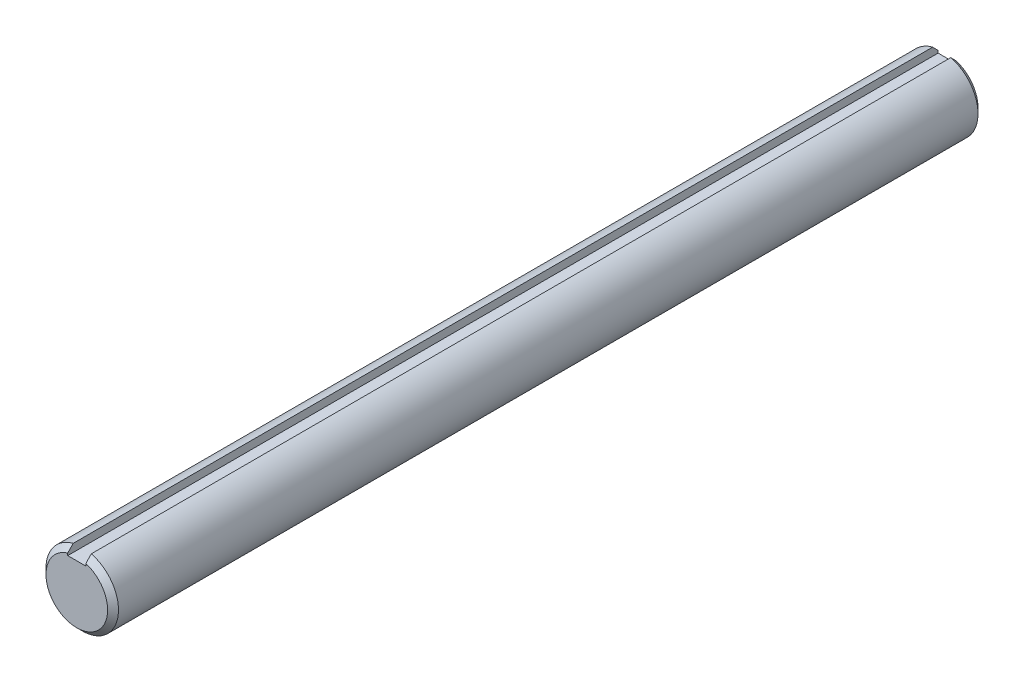
ISO-10303-21;
HEADER;
FILE_DESCRIPTION(('STEP AP214'),'2;1');
FILE_NAME('part.step','',(''),(''),'','','');
FILE_SCHEMA(('AUTOMOTIVE_DESIGN { 1 0 10303 214 1 1 1 1 }'));
ENDSEC;
DATA;
#1=APPLICATION_CONTEXT('core data for automotive mechanical design processes');
#2=APPLICATION_PROTOCOL_DEFINITION('international standard','automotive_design',2000,#1);
#3=PRODUCT_CONTEXT('',#1,'mechanical');
#4=PRODUCT('Part','Part','',(#3));
#5=PRODUCT_RELATED_PRODUCT_CATEGORY('part','',(#4));
#6=PRODUCT_DEFINITION_FORMATION('','',#4);
#7=PRODUCT_DEFINITION_CONTEXT('part definition',#1,'design');
#8=PRODUCT_DEFINITION('design','',#6,#7);
#9=PRODUCT_DEFINITION_SHAPE('','',#8);
#10=(LENGTH_UNIT() NAMED_UNIT(*) SI_UNIT(.MILLI.,.METRE.));
#11=(NAMED_UNIT(*) PLANE_ANGLE_UNIT() SI_UNIT($,.RADIAN.));
#12=(NAMED_UNIT(*) SI_UNIT($,.STERADIAN.) SOLID_ANGLE_UNIT());
#13=UNCERTAINTY_MEASURE_WITH_UNIT(LENGTH_MEASURE(1.E-05),#10,'distance_accuracy_value','');
#14=(GEOMETRIC_REPRESENTATION_CONTEXT(3) GLOBAL_UNCERTAINTY_ASSIGNED_CONTEXT((#13)) GLOBAL_UNIT_ASSIGNED_CONTEXT((#10,
#11,#12)) REPRESENTATION_CONTEXT('',''));
#15=CARTESIAN_POINT('',(0.,0.,0.));
#16=DIRECTION('',(0.,0.,1.));
#17=DIRECTION('',(1.,0.,0.));
#18=AXIS2_PLACEMENT_3D('',#15,#16,#17);
#19=CARTESIAN_POINT('',(0.,0.,76.2));
#20=DIRECTION('',(0.,0.,-1.));
#21=DIRECTION('',(-1.,0.,0.));
#22=AXIS2_PLACEMENT_3D('',#19,#20,#21);
#23=CYLINDRICAL_SURFACE('',#22,6.35);
#24=CARTESIAN_POINT('',(0.,0.,75.2475));
#25=DIRECTION('',(0.,0.,1.));
#26=DIRECTION('',(1.,0.,0.));
#27=AXIS2_PLACEMENT_3D('',#24,#25,#26);
#28=CIRCLE('',#27,6.35);
#29=CARTESIAN_POINT('',(1.5875,6.14836106210428,75.2475));
#30=VERTEX_POINT('',#29);
#31=CARTESIAN_POINT('',(-1.5875,6.14836106210428,75.2475));
#32=VERTEX_POINT('',#31);
#33=EDGE_CURVE('E149',#30,#32,#28,.F.);
#34=ORIENTED_EDGE('',*,*,#33,.T.);
#35=DIRECTION('',(0.,0.,-1.));
#36=VECTOR('',#35,1.);
#37=CARTESIAN_POINT('',(-1.5875,6.14836106210427,76.2));
#38=LINE('',#37,#36);
#39=CARTESIAN_POINT('',(-1.5875,6.14836106210427,-75.2474999999999));
#40=VERTEX_POINT('',#39);
#41=EDGE_CURVE('E127',#32,#40,#38,.T.);
#42=ORIENTED_EDGE('',*,*,#41,.T.);
#43=CARTESIAN_POINT('',(0.,0.,-75.2474999999999));
#44=DIRECTION('',(0.,0.,1.));
#45=DIRECTION('',(1.,0.,0.));
#46=AXIS2_PLACEMENT_3D('',#43,#44,#45);
#47=CIRCLE('',#46,6.35);
#48=CARTESIAN_POINT('',(1.5875,6.14836106210427,-75.2474999999999));
#49=VERTEX_POINT('',#48);
#50=EDGE_CURVE('E146',#40,#49,#47,.T.);
#51=ORIENTED_EDGE('',*,*,#50,.T.);
#52=DIRECTION('',(0.,0.,-1.));
#53=VECTOR('',#52,1.);
#54=CARTESIAN_POINT('',(1.5875,6.14836106210427,76.2));
#55=LINE('',#54,#53);
#56=EDGE_CURVE('E117',#49,#30,#55,.F.);
#57=ORIENTED_EDGE('',*,*,#56,.T.);
#58=EDGE_LOOP('',(#34,#42,#51,#57));
#59=FACE_BOUND('',#58,.T.);
#60=ADVANCED_FACE('F32',(#59),#23,.T.);
#61=CARTESIAN_POINT('',(0.,0.,76.2));
#62=DIRECTION('',(0.,0.,1.));
#63=DIRECTION('',(1.,0.,0.));
#64=AXIS2_PLACEMENT_3D('',#61,#62,#63);
#65=PLANE('',#64);
#66=DIRECTION('',(0.,-1.,0.));
#67=VECTOR('',#66,1.);
#68=CARTESIAN_POINT('',(-1.5875,6.35,76.2));
#69=LINE('',#68,#67);
#70=CARTESIAN_POINT('',(-1.5875,5.15876438694386,76.2));
#71=VERTEX_POINT('',#70);
#72=CARTESIAN_POINT('',(-1.5875,4.7625,76.2));
#73=VERTEX_POINT('',#72);
#74=EDGE_CURVE('E87',#71,#73,#69,.T.);
#75=ORIENTED_EDGE('',*,*,#74,.F.);
#76=CARTESIAN_POINT('',(0.,0.,76.2));
#77=DIRECTION('',(0.,0.,1.));
#78=DIRECTION('',(1.,0.,0.));
#79=AXIS2_PLACEMENT_3D('',#76,#77,#78);
#80=CIRCLE('',#79,5.39750000000003);
#81=CARTESIAN_POINT('',(1.5875,5.15876438694386,76.2));
#82=VERTEX_POINT('',#81);
#83=EDGE_CURVE('E141',#71,#82,#80,.T.);
#84=ORIENTED_EDGE('',*,*,#83,.T.);
#85=DIRECTION('',(0.,1.,0.));
#86=VECTOR('',#85,1.);
#87=CARTESIAN_POINT('',(1.5875,6.35,76.2));
#88=LINE('',#87,#86);
#89=CARTESIAN_POINT('',(1.5875,4.7625,76.2));
#90=VERTEX_POINT('',#89);
#91=EDGE_CURVE('E52',#90,#82,#88,.T.);
#92=ORIENTED_EDGE('',*,*,#91,.F.);
#93=DIRECTION('',(1.,0.,0.));
#94=VECTOR('',#93,1.);
#95=CARTESIAN_POINT('',(-1.5875,4.7625,76.2));
#96=LINE('',#95,#94);
#97=EDGE_CURVE('E97',#73,#90,#96,.T.);
#98=ORIENTED_EDGE('',*,*,#97,.F.);
#99=EDGE_LOOP('',(#75,#84,#92,#98));
#100=FACE_BOUND('',#99,.T.);
#101=ADVANCED_FACE('F108',(#100),#65,.T.);
#102=CARTESIAN_POINT('',(0.,0.,-76.2));
#103=DIRECTION('',(0.,0.,1.));
#104=DIRECTION('',(1.,0.,0.));
#105=AXIS2_PLACEMENT_3D('',#102,#103,#104);
#106=PLANE('',#105);
#107=CARTESIAN_POINT('',(0.,0.,-76.2));
#108=DIRECTION('',(0.,0.,1.));
#109=DIRECTION('',(1.,0.,0.));
#110=AXIS2_PLACEMENT_3D('',#107,#108,#109);
#111=CIRCLE('',#110,5.39749999999989);
#112=CARTESIAN_POINT('',(1.5875,5.15876438694372,-76.2));
#113=VERTEX_POINT('',#112);
#114=CARTESIAN_POINT('',(-1.5875,5.15876438694372,-76.2));
#115=VERTEX_POINT('',#114);
#116=EDGE_CURVE('E143',#113,#115,#111,.F.);
#117=ORIENTED_EDGE('',*,*,#116,.T.);
#118=DIRECTION('',(0.,-1.,0.));
#119=VECTOR('',#118,1.);
#120=CARTESIAN_POINT('',(-1.5875,6.35,-76.2));
#121=LINE('',#120,#119);
#122=CARTESIAN_POINT('',(-1.5875,4.7625,-76.2));
#123=VERTEX_POINT('',#122);
#124=EDGE_CURVE('E110',#115,#123,#121,.T.);
#125=ORIENTED_EDGE('',*,*,#124,.T.);
#126=DIRECTION('',(1.,0.,0.));
#127=VECTOR('',#126,1.);
#128=CARTESIAN_POINT('',(-1.5875,4.7625,-76.2));
#129=LINE('',#128,#127);
#130=CARTESIAN_POINT('',(1.5875,4.7625,-76.2));
#131=VERTEX_POINT('',#130);
#132=EDGE_CURVE('E103',#123,#131,#129,.T.);
#133=ORIENTED_EDGE('',*,*,#132,.T.);
#134=DIRECTION('',(0.,1.,0.));
#135=VECTOR('',#134,1.);
#136=CARTESIAN_POINT('',(1.5875,6.35,-76.2));
#137=LINE('',#136,#135);
#138=EDGE_CURVE('E106',#131,#113,#137,.T.);
#139=ORIENTED_EDGE('',*,*,#138,.T.);
#140=EDGE_LOOP('',(#117,#125,#133,#139));
#141=FACE_BOUND('',#140,.T.);
#142=ADVANCED_FACE('F160',(#141),#106,.F.);
#143=CARTESIAN_POINT('',(0.,0.,-75.2474999999999));
#144=DIRECTION('',(0.,0.,1.));
#145=DIRECTION('',(1.,0.,0.));
#146=AXIS2_PLACEMENT_3D('',#143,#144,#145);
#147=CONICAL_SURFACE('',#146,6.35,0.785398163397451);
#148=CARTESIAN_POINT('',(-1.5875,2.50467512422004,-78.6321073231548));
#149=CARTESIAN_POINT('',(-1.5875,2.6199574879908,-78.5346705663947));
#150=CARTESIAN_POINT('',(-1.5875,2.73434819416604,-78.4361940960173));
#151=CARTESIAN_POINT('',(-1.5875,2.96171067704997,-78.2376318023627));
#152=CARTESIAN_POINT('',(-1.5875,3.07468256144112,-78.1375461025497));
#153=CARTESIAN_POINT('',(-1.5875,3.29956921576393,-77.9362383617078));
#154=CARTESIAN_POINT('',(-1.5875,3.41148417069844,-77.8350165265981));
#155=CARTESIAN_POINT('',(-1.5875,3.63450717009294,-77.6316835974312));
#156=CARTESIAN_POINT('',(-1.5875,3.74561519672356,-77.5295724838341));
#157=CARTESIAN_POINT('',(-1.5875,4.0779404146334,-77.2222751639229));
#158=CARTESIAN_POINT('',(-1.5875,4.29821694512226,-77.0160724676453));
#159=CARTESIAN_POINT('',(-1.5875,4.73715914530377,-76.6019423042723));
#160=CARTESIAN_POINT('',(-1.5875,4.95582472940174,-76.3940147467598));
#161=CARTESIAN_POINT('',(-1.5875,5.3919758515553,-75.9770487299095));
#162=CARTESIAN_POINT('',(-1.5875,5.60946170363256,-75.7680105987989));
#163=CARTESIAN_POINT('',(-1.5875,6.04362892921901,-75.3491110156674));
#164=CARTESIAN_POINT('',(-1.5875,6.26031032050704,-75.1392495820551));
#165=CARTESIAN_POINT('',(-1.5875,6.69313054205313,-74.7188746527964));
#166=CARTESIAN_POINT('',(-1.5875,6.90926924461324,-74.5083610257473));
#167=CARTESIAN_POINT('',(-1.5875,7.34108970538697,-74.0868665375563));
#168=CARTESIAN_POINT('',(-1.5875,7.55677146466178,-73.8758856775018));
#169=CARTESIAN_POINT('',(-1.5875,7.77229162734195,-73.6647404933434));
#170=B_SPLINE_CURVE_WITH_KNOTS('',3,(#148,#149,#150,#151,#152,#153,#154,#155,#156,#157,#158,
#159,#160,#161,#162,#163,#164,#165,#166,#167,#168,#169),.UNSPECIFIED.,.F.,.F.,(4,2,2,2,2,2,2,2,
2,2,4),(0.,0.452810247519127,0.905585918444131,1.35828081011678,1.81098567399958,
2.71616025534631,3.6213825895487,4.52635081760593,5.43129892508637,6.33644306352773,
7.24158509760043),.UNSPECIFIED.);
#171=EDGE_CURVE('E60',#115,#40,#170,.T.);
#172=ORIENTED_EDGE('',*,*,#171,.F.);
#173=ORIENTED_EDGE('',*,*,#116,.F.);
#174=CARTESIAN_POINT('',(1.5875,7.77229162734195,-73.6647404933434));
#175=CARTESIAN_POINT('',(1.5875,7.55677146466178,-73.8758856775018));
#176=CARTESIAN_POINT('',(1.5875,7.34108970538697,-74.0868665375563));
#177=CARTESIAN_POINT('',(1.5875,6.90926924461324,-74.5083610257473));
#178=CARTESIAN_POINT('',(1.5875,6.69313054205313,-74.7188746527964));
#179=CARTESIAN_POINT('',(1.5875,6.26031032050704,-75.1392495820551));
#180=CARTESIAN_POINT('',(1.5875,6.04362892921901,-75.3491110156674));
#181=CARTESIAN_POINT('',(1.5875,5.60946170363256,-75.7680105987989));
#182=CARTESIAN_POINT('',(1.5875,5.3919758515553,-75.9770487299095));
#183=CARTESIAN_POINT('',(1.5875,4.95582472940174,-76.3940147467598));
#184=CARTESIAN_POINT('',(1.5875,4.73715914530377,-76.6019423042723));
#185=CARTESIAN_POINT('',(1.5875,4.29821694512226,-77.0160724676453));
#186=CARTESIAN_POINT('',(1.5875,4.0779404146334,-77.2222751639229));
#187=CARTESIAN_POINT('',(1.5875,3.74561519672356,-77.5295724838341));
#188=CARTESIAN_POINT('',(1.5875,3.63450717009294,-77.6316835974312));
#189=CARTESIAN_POINT('',(1.5875,3.41148417069844,-77.8350165265981));
#190=CARTESIAN_POINT('',(1.5875,3.29956921576393,-77.9362383617078));
#191=CARTESIAN_POINT('',(1.5875,3.07468256144112,-78.1375461025497));
#192=CARTESIAN_POINT('',(1.5875,2.96171067704997,-78.2376318023627));
#193=CARTESIAN_POINT('',(1.5875,2.73434819416604,-78.4361940960173));
#194=CARTESIAN_POINT('',(1.5875,2.6199574879908,-78.5346705663947));
#195=CARTESIAN_POINT('',(1.5875,2.50467512422004,-78.6321073231548));
#196=B_SPLINE_CURVE_WITH_KNOTS('',3,(#174,#175,#176,#177,#178,#179,#180,#181,#182,#183,#184,
#185,#186,#187,#188,#189,#190,#191,#192,#193,#194,#195),.UNSPECIFIED.,.F.,.F.,(4,2,2,2,2,2,2,2,
2,2,4),(0.,0.905142034072703,1.81028617251406,2.7152342799945,3.62020250805173,4.52542484225412,
5.43059942360086,5.88330428748366,6.3359991791563,6.7887748500813,7.24158509760043),.UNSPECIFIED.);
#197=EDGE_CURVE('E121',#49,#113,#196,.T.);
#198=ORIENTED_EDGE('',*,*,#197,.F.);
#199=ORIENTED_EDGE('',*,*,#50,.F.);
#200=EDGE_LOOP('',(#172,#173,#198,#199));
#201=FACE_BOUND('',#200,.T.);
#202=ADVANCED_FACE('F129',(#201),#147,.T.);
#203=CARTESIAN_POINT('',(0.,0.,76.2));
#204=DIRECTION('',(0.,0.,-1.));
#205=DIRECTION('',(-1.,0.,0.));
#206=AXIS2_PLACEMENT_3D('',#203,#204,#205);
#207=CONICAL_SURFACE('',#206,5.39750000000003,0.785398163397451);
#208=CARTESIAN_POINT('',(-1.5875,7.77229162734195,73.6647404933435));
#209=CARTESIAN_POINT('',(-1.5875,7.55677146466177,73.875885677502));
#210=CARTESIAN_POINT('',(-1.5875,7.34108970538697,74.0868665375564));
#211=CARTESIAN_POINT('',(-1.5875,6.90926924461325,74.5083610257474));
#212=CARTESIAN_POINT('',(-1.5875,6.69313054205315,74.7188746527965));
#213=CARTESIAN_POINT('',(-1.5875,6.26031032050707,75.1392495820552));
#214=CARTESIAN_POINT('',(-1.5875,6.04362892921905,75.3491110156675));
#215=CARTESIAN_POINT('',(-1.5875,5.60946170363261,75.768010598799));
#216=CARTESIAN_POINT('',(-1.5875,5.39197585155535,75.9770487299096));
#217=CARTESIAN_POINT('',(-1.5875,4.9558247294018,76.3940147467598));
#218=CARTESIAN_POINT('',(-1.5875,4.73715914530384,76.6019423042723));
#219=CARTESIAN_POINT('',(-1.5875,4.29821694512234,77.0160724676454));
#220=CARTESIAN_POINT('',(-1.5875,4.07794041463349,77.222275163923));
#221=CARTESIAN_POINT('',(-1.5875,3.74561519672365,77.5295724838341));
#222=CARTESIAN_POINT('',(-1.5875,3.63450717009303,77.6316835974312));
#223=CARTESIAN_POINT('',(-1.5875,3.41148417069854,77.8350165265982));
#224=CARTESIAN_POINT('',(-1.5875,3.29956921576404,77.9362383617079));
#225=CARTESIAN_POINT('',(-1.5875,3.07468256144125,78.1375461025497));
#226=CARTESIAN_POINT('',(-1.5875,2.9617106770501,78.2376318023627));
#227=CARTESIAN_POINT('',(-1.5875,2.73434819416617,78.4361940960173));
#228=CARTESIAN_POINT('',(-1.5875,2.61995748799092,78.5346705663947));
#229=CARTESIAN_POINT('',(-1.5875,2.50467512422016,78.6321073231548));
#230=B_SPLINE_CURVE_WITH_KNOTS('',3,(#208,#209,#210,#211,#212,#213,#214,#215,#216,#217,#218,
#219,#220,#221,#222,#223,#224,#225,#226,#227,#228,#229),.UNSPECIFIED.,.F.,.F.,(4,2,2,2,2,2,2,2,
2,2,4),(0.,0.90514203407267,1.810286172514,2.71523427999443,3.62020250805164,4.525424842254,
5.43059942360071,5.8833042874835,6.33599917915614,6.78877485008111,7.24158509760025),.UNSPECIFIED.);
#231=EDGE_CURVE('E11',#32,#71,#230,.T.);
#232=ORIENTED_EDGE('',*,*,#231,.F.);
#233=ORIENTED_EDGE('',*,*,#33,.F.);
#234=CARTESIAN_POINT('',(1.5875,2.50467512422016,78.6321073231548));
#235=CARTESIAN_POINT('',(1.5875,2.61995748799092,78.5346705663947));
#236=CARTESIAN_POINT('',(1.5875,2.73434819416616,78.4361940960173));
#237=CARTESIAN_POINT('',(1.5875,2.96171067705008,78.2376318023627));
#238=CARTESIAN_POINT('',(1.5875,3.07468256144124,78.1375461025497));
#239=CARTESIAN_POINT('',(1.5875,3.29956921576404,77.9362383617079));
#240=CARTESIAN_POINT('',(1.5875,3.41148417069855,77.8350165265982));
#241=CARTESIAN_POINT('',(1.5875,3.63450717009304,77.6316835974312));
#242=CARTESIAN_POINT('',(1.5875,3.74561519672365,77.5295724838341));
#243=CARTESIAN_POINT('',(1.5875,4.07794041463348,77.222275163923));
#244=CARTESIAN_POINT('',(1.5875,4.29821694512234,77.0160724676454));
#245=CARTESIAN_POINT('',(1.5875,4.73715914530384,76.6019423042723));
#246=CARTESIAN_POINT('',(1.5875,4.9558247294018,76.3940147467598));
#247=CARTESIAN_POINT('',(1.5875,5.39197585155535,75.9770487299096));
#248=CARTESIAN_POINT('',(1.5875,5.60946170363261,75.768010598799));
#249=CARTESIAN_POINT('',(1.5875,6.04362892921905,75.3491110156675));
#250=CARTESIAN_POINT('',(1.5875,6.26031032050707,75.1392495820552));
#251=CARTESIAN_POINT('',(1.5875,6.69313054205315,74.7188746527965));
#252=CARTESIAN_POINT('',(1.5875,6.90926924461325,74.5083610257474));
#253=CARTESIAN_POINT('',(1.5875,7.34108970538698,74.0868665375564));
#254=CARTESIAN_POINT('',(1.5875,7.55677146466177,73.875885677502));
#255=CARTESIAN_POINT('',(1.5875,7.77229162734195,73.6647404933435));
#256=B_SPLINE_CURVE_WITH_KNOTS('',3,(#234,#235,#236,#237,#238,#239,#240,#241,#242,#243,#244,
#245,#246,#247,#248,#249,#250,#251,#252,#253,#254,#255),.UNSPECIFIED.,.F.,.F.,(4,2,2,2,2,2,2,2,
2,2,4),(0.,0.452810247519126,0.90558591844411,1.35828081011675,1.81098567399953,
2.71616025534625,3.62138258954861,4.52635081760582,5.43129892508625,6.33644306352758,
7.24158509760025),.UNSPECIFIED.);
#257=EDGE_CURVE('E45',#82,#30,#256,.T.);
#258=ORIENTED_EDGE('',*,*,#257,.F.);
#259=ORIENTED_EDGE('',*,*,#83,.F.);
#260=EDGE_LOOP('',(#232,#233,#258,#259));
#261=FACE_BOUND('',#260,.T.);
#262=ADVANCED_FACE('F34',(#261),#207,.T.);
#263=CARTESIAN_POINT('',(-1.5875,6.35,-76.2));
#264=DIRECTION('',(-1.,0.,0.));
#265=DIRECTION('',(0.,-1.,0.));
#266=AXIS2_PLACEMENT_3D('',#263,#264,#265);
#267=PLANE('',#266);
#268=ORIENTED_EDGE('',*,*,#171,.T.);
#269=ORIENTED_EDGE('',*,*,#41,.F.);
#270=ORIENTED_EDGE('',*,*,#231,.T.);
#271=ORIENTED_EDGE('',*,*,#74,.T.);
#272=DIRECTION('',(0.,0.,1.));
#273=VECTOR('',#272,1.);
#274=CARTESIAN_POINT('',(-1.5875,4.7625,-76.2));
#275=LINE('',#274,#273);
#276=EDGE_CURVE('E90',#123,#73,#275,.T.);
#277=ORIENTED_EDGE('',*,*,#276,.F.);
#278=ORIENTED_EDGE('',*,*,#124,.F.);
#279=EDGE_LOOP('',(#268,#269,#270,#271,#277,#278));
#280=FACE_BOUND('',#279,.T.);
#281=ADVANCED_FACE('F89',(#280),#267,.F.);
#282=CARTESIAN_POINT('',(1.5875,6.35,-76.2));
#283=DIRECTION('',(1.,0.,0.));
#284=DIRECTION('',(0.,1.,0.));
#285=AXIS2_PLACEMENT_3D('',#282,#283,#284);
#286=PLANE('',#285);
#287=ORIENTED_EDGE('',*,*,#197,.T.);
#288=ORIENTED_EDGE('',*,*,#138,.F.);
#289=DIRECTION('',(0.,0.,1.));
#290=VECTOR('',#289,1.);
#291=CARTESIAN_POINT('',(1.5875,4.7625,-76.2));
#292=LINE('',#291,#290);
#293=EDGE_CURVE('E105',#131,#90,#292,.T.);
#294=ORIENTED_EDGE('',*,*,#293,.T.);
#295=ORIENTED_EDGE('',*,*,#91,.T.);
#296=ORIENTED_EDGE('',*,*,#257,.T.);
#297=ORIENTED_EDGE('',*,*,#56,.F.);
#298=EDGE_LOOP('',(#287,#288,#294,#295,#296,#297));
#299=FACE_BOUND('',#298,.T.);
#300=ADVANCED_FACE('F132',(#299),#286,.F.);
#301=CARTESIAN_POINT('',(-1.5875,4.7625,-76.2));
#302=DIRECTION('',(0.,-1.,0.));
#303=DIRECTION('',(0.,0.,-1.));
#304=AXIS2_PLACEMENT_3D('',#301,#302,#303);
#305=PLANE('',#304);
#306=ORIENTED_EDGE('',*,*,#293,.F.);
#307=ORIENTED_EDGE('',*,*,#132,.F.);
#308=ORIENTED_EDGE('',*,*,#276,.T.);
#309=ORIENTED_EDGE('',*,*,#97,.T.);
#310=EDGE_LOOP('',(#306,#307,#308,#309));
#311=FACE_BOUND('',#310,.T.);
#312=ADVANCED_FACE('F101',(#311),#305,.F.);
#313=CLOSED_SHELL('',(#60,#101,#142,#202,#262,#281,#300,#312));
#314=MANIFOLD_SOLID_BREP('B2',#313);
#315=ADVANCED_BREP_SHAPE_REPRESENTATION('',(#18,#314),#14);
#316=SHAPE_DEFINITION_REPRESENTATION(#9,#315);
ENDSEC;
END-ISO-10303-21;
